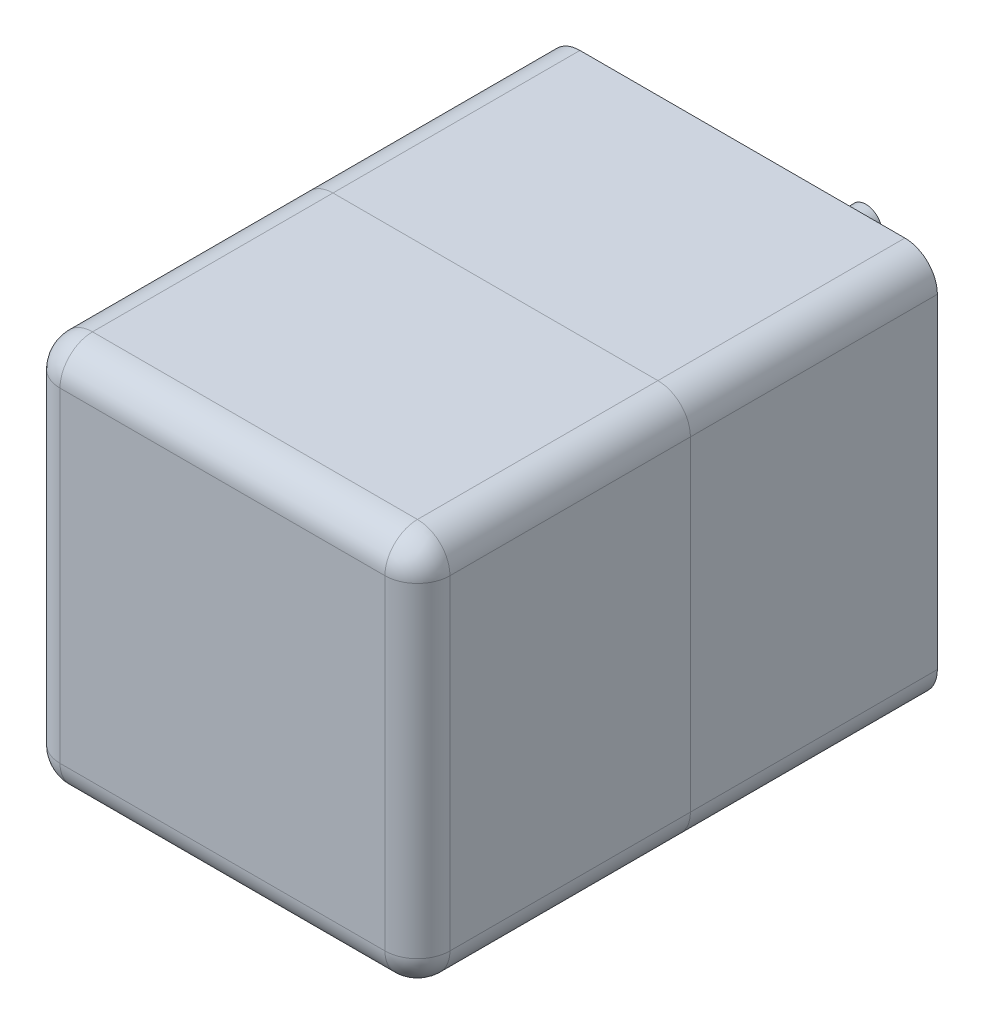
ISO-10303-21;
HEADER;
FILE_DESCRIPTION(('STEP AP214'),'2;1');
FILE_NAME('part.step','',(''),(''),'','','');
FILE_SCHEMA(('AUTOMOTIVE_DESIGN { 1 0 10303 214 1 1 1 1 }'));
ENDSEC;
DATA;
#1=APPLICATION_CONTEXT('core data for automotive mechanical design processes');
#2=APPLICATION_PROTOCOL_DEFINITION('international standard','automotive_design',2000,#1);
#3=PRODUCT_CONTEXT('',#1,'mechanical');
#4=PRODUCT('Part','Part','',(#3));
#5=PRODUCT_RELATED_PRODUCT_CATEGORY('part','',(#4));
#6=PRODUCT_DEFINITION_FORMATION('','',#4);
#7=PRODUCT_DEFINITION_CONTEXT('part definition',#1,'design');
#8=PRODUCT_DEFINITION('design','',#6,#7);
#9=PRODUCT_DEFINITION_SHAPE('','',#8);
#10=(LENGTH_UNIT() NAMED_UNIT(*) SI_UNIT(.MILLI.,.METRE.));
#11=(NAMED_UNIT(*) PLANE_ANGLE_UNIT() SI_UNIT($,.RADIAN.));
#12=(NAMED_UNIT(*) SI_UNIT($,.STERADIAN.) SOLID_ANGLE_UNIT());
#13=UNCERTAINTY_MEASURE_WITH_UNIT(LENGTH_MEASURE(1.E-05),#10,'distance_accuracy_value','');
#14=(GEOMETRIC_REPRESENTATION_CONTEXT(3) GLOBAL_UNCERTAINTY_ASSIGNED_CONTEXT((#13)) GLOBAL_UNIT_ASSIGNED_CONTEXT((#10,
#11,#12)) REPRESENTATION_CONTEXT('',''));
#15=CARTESIAN_POINT('',(0.,0.,0.));
#16=DIRECTION('',(0.,0.,1.));
#17=DIRECTION('',(1.,0.,0.));
#18=AXIS2_PLACEMENT_3D('',#15,#16,#17);
#19=CARTESIAN_POINT('',(60.,0.,-38.));
#20=DIRECTION('',(0.,1.,0.));
#21=DIRECTION('',(0.,0.,1.));
#22=AXIS2_PLACEMENT_3D('',#19,#20,#21);
#23=PLANE('',#22);
#24=DIRECTION('',(-1.,0.,0.));
#25=VECTOR('',#24,1.);
#26=CARTESIAN_POINT('',(60.,0.,0.));
#27=LINE('',#26,#25);
#28=CARTESIAN_POINT('',(55.,0.,0.));
#29=VERTEX_POINT('',#28);
#30=CARTESIAN_POINT('',(5.,0.,0.));
#31=VERTEX_POINT('',#30);
#32=EDGE_CURVE('E146',#29,#31,#27,.T.);
#33=ORIENTED_EDGE('',*,*,#32,.T.);
#34=DIRECTION('',(0.,0.,1.));
#35=VECTOR('',#34,1.);
#36=CARTESIAN_POINT('',(5.,0.,-38.));
#37=LINE('',#36,#35);
#38=CARTESIAN_POINT('',(5.,0.,-38.));
#39=VERTEX_POINT('',#38);
#40=EDGE_CURVE('E124',#31,#39,#37,.F.);
#41=ORIENTED_EDGE('',*,*,#40,.T.);
#42=DIRECTION('',(-1.,0.,0.));
#43=VECTOR('',#42,1.);
#44=CARTESIAN_POINT('',(60.,0.,-38.));
#45=LINE('',#44,#43);
#46=CARTESIAN_POINT('',(55.,0.,-38.));
#47=VERTEX_POINT('',#46);
#48=EDGE_CURVE('E156',#47,#39,#45,.T.);
#49=ORIENTED_EDGE('',*,*,#48,.F.);
#50=DIRECTION('',(0.,0.,1.));
#51=VECTOR('',#50,1.);
#52=CARTESIAN_POINT('',(55.,0.,-38.));
#53=LINE('',#52,#51);
#54=EDGE_CURVE('E129',#47,#29,#53,.T.);
#55=ORIENTED_EDGE('',*,*,#54,.T.);
#56=EDGE_LOOP('',(#33,#41,#49,#55));
#57=FACE_BOUND('',#56,.T.);
#58=ADVANCED_FACE('F53',(#57),#23,.F.);
#59=CARTESIAN_POINT('',(0.,0.,-38.));
#60=DIRECTION('',(1.,0.,0.));
#61=DIRECTION('',(0.,0.,-1.));
#62=AXIS2_PLACEMENT_3D('',#59,#60,#61);
#63=PLANE('',#62);
#64=DIRECTION('',(0.,1.,0.));
#65=VECTOR('',#64,1.);
#66=CARTESIAN_POINT('',(0.,0.,-38.));
#67=LINE('',#66,#65);
#68=CARTESIAN_POINT('',(0.,5.,-38.));
#69=VERTEX_POINT('',#68);
#70=CARTESIAN_POINT('',(0.,55.,-38.));
#71=VERTEX_POINT('',#70);
#72=EDGE_CURVE('E139',#69,#71,#67,.T.);
#73=ORIENTED_EDGE('',*,*,#72,.F.);
#74=DIRECTION('',(0.,0.,1.));
#75=VECTOR('',#74,1.);
#76=CARTESIAN_POINT('',(0.,5.,-38.));
#77=LINE('',#76,#75);
#78=CARTESIAN_POINT('',(0.,5.,0.));
#79=VERTEX_POINT('',#78);
#80=EDGE_CURVE('E123',#69,#79,#77,.T.);
#81=ORIENTED_EDGE('',*,*,#80,.T.);
#82=DIRECTION('',(0.,1.,0.));
#83=VECTOR('',#82,1.);
#84=CARTESIAN_POINT('',(0.,0.,0.));
#85=LINE('',#84,#83);
#86=CARTESIAN_POINT('',(0.,55.,0.));
#87=VERTEX_POINT('',#86);
#88=EDGE_CURVE('E136',#79,#87,#85,.T.);
#89=ORIENTED_EDGE('',*,*,#88,.T.);
#90=DIRECTION('',(0.,0.,1.));
#91=VECTOR('',#90,1.);
#92=CARTESIAN_POINT('',(0.,55.,-38.));
#93=LINE('',#92,#91);
#94=EDGE_CURVE('E141',#87,#71,#93,.F.);
#95=ORIENTED_EDGE('',*,*,#94,.T.);
#96=EDGE_LOOP('',(#73,#81,#89,#95));
#97=FACE_BOUND('',#96,.T.);
#98=ADVANCED_FACE('F135',(#97),#63,.F.);
#99=CARTESIAN_POINT('',(0.,60.,-38.));
#100=DIRECTION('',(0.,-1.,0.));
#101=DIRECTION('',(0.,0.,-1.));
#102=AXIS2_PLACEMENT_3D('',#99,#100,#101);
#103=PLANE('',#102);
#104=DIRECTION('',(1.,0.,0.));
#105=VECTOR('',#104,1.);
#106=CARTESIAN_POINT('',(0.,60.,0.));
#107=LINE('',#106,#105);
#108=CARTESIAN_POINT('',(5.,60.,0.));
#109=VERTEX_POINT('',#108);
#110=CARTESIAN_POINT('',(55.,60.,0.));
#111=VERTEX_POINT('',#110);
#112=EDGE_CURVE('E145',#109,#111,#107,.T.);
#113=ORIENTED_EDGE('',*,*,#112,.T.);
#114=DIRECTION('',(0.,0.,1.));
#115=VECTOR('',#114,1.);
#116=CARTESIAN_POINT('',(55.,60.,-38.));
#117=LINE('',#116,#115);
#118=CARTESIAN_POINT('',(55.,60.,-38.));
#119=VERTEX_POINT('',#118);
#120=EDGE_CURVE('E12',#111,#119,#117,.F.);
#121=ORIENTED_EDGE('',*,*,#120,.T.);
#122=DIRECTION('',(1.,0.,0.));
#123=VECTOR('',#122,1.);
#124=CARTESIAN_POINT('',(0.,60.,-38.));
#125=LINE('',#124,#123);
#126=CARTESIAN_POINT('',(5.,60.,-38.));
#127=VERTEX_POINT('',#126);
#128=EDGE_CURVE('E182',#127,#119,#125,.T.);
#129=ORIENTED_EDGE('',*,*,#128,.F.);
#130=DIRECTION('',(0.,0.,1.));
#131=VECTOR('',#130,1.);
#132=CARTESIAN_POINT('',(5.,60.,-38.));
#133=LINE('',#132,#131);
#134=EDGE_CURVE('E61',#127,#109,#133,.T.);
#135=ORIENTED_EDGE('',*,*,#134,.T.);
#136=EDGE_LOOP('',(#113,#121,#129,#135));
#137=FACE_BOUND('',#136,.T.);
#138=ADVANCED_FACE('F180',(#137),#103,.F.);
#139=CARTESIAN_POINT('',(60.,60.,-38.));
#140=DIRECTION('',(-1.,0.,0.));
#141=DIRECTION('',(0.,0.,1.));
#142=AXIS2_PLACEMENT_3D('',#139,#140,#141);
#143=PLANE('',#142);
#144=DIRECTION('',(0.,-1.,0.));
#145=VECTOR('',#144,1.);
#146=CARTESIAN_POINT('',(60.,60.,0.));
#147=LINE('',#146,#145);
#148=CARTESIAN_POINT('',(60.,55.,0.));
#149=VERTEX_POINT('',#148);
#150=CARTESIAN_POINT('',(60.,5.,0.));
#151=VERTEX_POINT('',#150);
#152=EDGE_CURVE('E149',#149,#151,#147,.T.);
#153=ORIENTED_EDGE('',*,*,#152,.T.);
#154=DIRECTION('',(0.,0.,1.));
#155=VECTOR('',#154,1.);
#156=CARTESIAN_POINT('',(60.,5.,-38.));
#157=LINE('',#156,#155);
#158=CARTESIAN_POINT('',(60.,5.,-38.));
#159=VERTEX_POINT('',#158);
#160=EDGE_CURVE('E68',#151,#159,#157,.F.);
#161=ORIENTED_EDGE('',*,*,#160,.T.);
#162=DIRECTION('',(0.,-1.,0.));
#163=VECTOR('',#162,1.);
#164=CARTESIAN_POINT('',(60.,60.,-38.));
#165=LINE('',#164,#163);
#166=CARTESIAN_POINT('',(60.,55.,-38.));
#167=VERTEX_POINT('',#166);
#168=EDGE_CURVE('E157',#167,#159,#165,.T.);
#169=ORIENTED_EDGE('',*,*,#168,.F.);
#170=DIRECTION('',(0.,0.,1.));
#171=VECTOR('',#170,1.);
#172=CARTESIAN_POINT('',(60.,55.,-38.));
#173=LINE('',#172,#171);
#174=EDGE_CURVE('E173',#167,#149,#173,.T.);
#175=ORIENTED_EDGE('',*,*,#174,.T.);
#176=EDGE_LOOP('',(#153,#161,#169,#175));
#177=FACE_BOUND('',#176,.T.);
#178=ADVANCED_FACE('F189',(#177),#143,.F.);
#179=CARTESIAN_POINT('',(0.,0.,-38.));
#180=DIRECTION('',(0.,0.,-1.));
#181=DIRECTION('',(-1.,0.,0.));
#182=AXIS2_PLACEMENT_3D('',#179,#180,#181);
#183=PLANE('',#182);
#184=CARTESIAN_POINT('',(30.,40.,-38.));
#185=DIRECTION('',(0.,0.,-1.));
#186=DIRECTION('',(-1.,0.,0.));
#187=AXIS2_PLACEMENT_3D('',#184,#185,#186);
#188=CIRCLE('',#187,12.);
#189=CARTESIAN_POINT('',(18.,40.,-38.));
#190=VERTEX_POINT('',#189);
#191=EDGE_CURVE('E220',#190,#190,#188,.T.);
#192=ORIENTED_EDGE('',*,*,#191,.F.);
#193=EDGE_LOOP('',(#192));
#194=FACE_BOUND('',#193,.T.);
#195=CARTESIAN_POINT('',(5.25126265847084,5.25126265847083,-38.));
#196=DIRECTION('',(0.,0.,-1.));
#197=DIRECTION('',(1.,0.,0.));
#198=AXIS2_PLACEMENT_3D('',#195,#196,#197);
#199=CIRCLE('',#198,2.25);
#200=CARTESIAN_POINT('',(7.50126265847084,5.25126265847083,-38.));
#201=VERTEX_POINT('',#200);
#202=EDGE_CURVE('E202',#201,#201,#199,.T.);
#203=ORIENTED_EDGE('',*,*,#202,.F.);
#204=EDGE_LOOP('',(#203));
#205=FACE_BOUND('',#204,.T.);
#206=CARTESIAN_POINT('',(54.7487373415292,5.25126265847084,-38.));
#207=DIRECTION('',(0.,0.,-1.));
#208=DIRECTION('',(-1.,0.,0.));
#209=AXIS2_PLACEMENT_3D('',#206,#207,#208);
#210=CIRCLE('',#209,2.25);
#211=CARTESIAN_POINT('',(52.4987373415292,5.25126265847084,-38.));
#212=VERTEX_POINT('',#211);
#213=EDGE_CURVE('E209',#212,#212,#210,.T.);
#214=ORIENTED_EDGE('',*,*,#213,.F.);
#215=EDGE_LOOP('',(#214));
#216=FACE_BOUND('',#215,.T.);
#217=CARTESIAN_POINT('',(54.7487373415292,54.7487373415292,-38.));
#218=DIRECTION('',(0.,0.,-1.));
#219=DIRECTION('',(1.,0.,0.));
#220=AXIS2_PLACEMENT_3D('',#217,#218,#219);
#221=CIRCLE('',#220,2.25);
#222=CARTESIAN_POINT('',(56.9987373415292,54.7487373415292,-38.));
#223=VERTEX_POINT('',#222);
#224=EDGE_CURVE('E215',#223,#223,#221,.T.);
#225=ORIENTED_EDGE('',*,*,#224,.F.);
#226=EDGE_LOOP('',(#225));
#227=FACE_BOUND('',#226,.T.);
#228=CARTESIAN_POINT('',(5.25126265847084,54.7487373415292,-38.));
#229=DIRECTION('',(0.,0.,-1.));
#230=DIRECTION('',(-1.,0.,0.));
#231=AXIS2_PLACEMENT_3D('',#228,#229,#230);
#232=CIRCLE('',#231,2.25);
#233=CARTESIAN_POINT('',(3.00126265847084,54.7487373415292,-38.));
#234=VERTEX_POINT('',#233);
#235=EDGE_CURVE('E196',#234,#234,#232,.T.);
#236=ORIENTED_EDGE('',*,*,#235,.F.);
#237=EDGE_LOOP('',(#236));
#238=FACE_BOUND('',#237,.T.);
#239=ORIENTED_EDGE('',*,*,#48,.T.);
#240=CARTESIAN_POINT('',(5.,5.,-38.));
#241=DIRECTION('',(0.,0.,-1.));
#242=DIRECTION('',(-1.,0.,0.));
#243=AXIS2_PLACEMENT_3D('',#240,#241,#242);
#244=CIRCLE('',#243,5.);
#245=EDGE_CURVE('E171',#39,#69,#244,.T.);
#246=ORIENTED_EDGE('',*,*,#245,.T.);
#247=ORIENTED_EDGE('',*,*,#72,.T.);
#248=CARTESIAN_POINT('',(5.,55.,-38.));
#249=DIRECTION('',(0.,0.,-1.));
#250=DIRECTION('',(-1.,0.,0.));
#251=AXIS2_PLACEMENT_3D('',#248,#249,#250);
#252=CIRCLE('',#251,5.);
#253=EDGE_CURVE('E166',#71,#127,#252,.T.);
#254=ORIENTED_EDGE('',*,*,#253,.T.);
#255=ORIENTED_EDGE('',*,*,#128,.T.);
#256=CARTESIAN_POINT('',(55.,55.,-38.));
#257=DIRECTION('',(0.,0.,-1.));
#258=DIRECTION('',(-1.,0.,0.));
#259=AXIS2_PLACEMENT_3D('',#256,#257,#258);
#260=CIRCLE('',#259,5.);
#261=EDGE_CURVE('E75',#119,#167,#260,.T.);
#262=ORIENTED_EDGE('',*,*,#261,.T.);
#263=ORIENTED_EDGE('',*,*,#168,.T.);
#264=CARTESIAN_POINT('',(55.,5.,-38.));
#265=DIRECTION('',(0.,0.,-1.));
#266=DIRECTION('',(-1.,0.,0.));
#267=AXIS2_PLACEMENT_3D('',#264,#265,#266);
#268=CIRCLE('',#267,5.);
#269=EDGE_CURVE('E169',#159,#47,#268,.T.);
#270=ORIENTED_EDGE('',*,*,#269,.T.);
#271=EDGE_LOOP('',(#239,#246,#247,#254,#255,#262,#263,#270));
#272=FACE_BOUND('',#271,.T.);
#273=ADVANCED_FACE('F289',(#194,#205,#216,#227,#238,#272),#183,.T.);
#274=CARTESIAN_POINT('',(0.,0.,0.));
#275=DIRECTION('',(0.,0.,-1.));
#276=DIRECTION('',(-1.,0.,0.));
#277=AXIS2_PLACEMENT_3D('',#274,#275,#276);
#278=PLANE('',#277);
#279=ORIENTED_EDGE('',*,*,#88,.F.);
#280=CARTESIAN_POINT('',(5.,5.,0.));
#281=DIRECTION('',(0.,0.,-1.));
#282=DIRECTION('',(-1.,0.,0.));
#283=AXIS2_PLACEMENT_3D('',#280,#281,#282);
#284=CIRCLE('',#283,5.);
#285=EDGE_CURVE('E119',#79,#31,#284,.F.);
#286=ORIENTED_EDGE('',*,*,#285,.T.);
#287=ORIENTED_EDGE('',*,*,#32,.F.);
#288=CARTESIAN_POINT('',(55.,5.,0.));
#289=DIRECTION('',(0.,0.,-1.));
#290=DIRECTION('',(-1.,0.,0.));
#291=AXIS2_PLACEMENT_3D('',#288,#289,#290);
#292=CIRCLE('',#291,5.);
#293=EDGE_CURVE('E130',#29,#151,#292,.F.);
#294=ORIENTED_EDGE('',*,*,#293,.T.);
#295=ORIENTED_EDGE('',*,*,#152,.F.);
#296=CARTESIAN_POINT('',(55.,55.,0.));
#297=DIRECTION('',(0.,0.,-1.));
#298=DIRECTION('',(-1.,0.,0.));
#299=AXIS2_PLACEMENT_3D('',#296,#297,#298);
#300=CIRCLE('',#299,5.);
#301=EDGE_CURVE('E160',#149,#111,#300,.F.);
#302=ORIENTED_EDGE('',*,*,#301,.T.);
#303=ORIENTED_EDGE('',*,*,#112,.F.);
#304=CARTESIAN_POINT('',(5.,55.,0.));
#305=DIRECTION('',(0.,0.,-1.));
#306=DIRECTION('',(-1.,0.,0.));
#307=AXIS2_PLACEMENT_3D('',#304,#305,#306);
#308=CIRCLE('',#307,5.);
#309=EDGE_CURVE('E140',#109,#87,#308,.F.);
#310=ORIENTED_EDGE('',*,*,#309,.T.);
#311=EDGE_LOOP('',(#279,#286,#287,#294,#295,#302,#303,#310));
#312=FACE_BOUND('',#311,.T.);
#313=ADVANCED_FACE('F143',(#312),#278,.F.);
#314=CARTESIAN_POINT('',(5.,5.,-38.));
#315=DIRECTION('',(0.,0.,1.));
#316=DIRECTION('',(1.,0.,0.));
#317=AXIS2_PLACEMENT_3D('',#314,#315,#316);
#318=CYLINDRICAL_SURFACE('',#317,5.);
#319=ORIENTED_EDGE('',*,*,#245,.F.);
#320=ORIENTED_EDGE('',*,*,#40,.F.);
#321=ORIENTED_EDGE('',*,*,#285,.F.);
#322=ORIENTED_EDGE('',*,*,#80,.F.);
#323=EDGE_LOOP('',(#319,#320,#321,#322));
#324=FACE_BOUND('',#323,.T.);
#325=ADVANCED_FACE('F122',(#324),#318,.T.);
#326=CARTESIAN_POINT('',(55.,5.,-38.));
#327=DIRECTION('',(0.,0.,1.));
#328=DIRECTION('',(1.,0.,0.));
#329=AXIS2_PLACEMENT_3D('',#326,#327,#328);
#330=CYLINDRICAL_SURFACE('',#329,5.);
#331=ORIENTED_EDGE('',*,*,#269,.F.);
#332=ORIENTED_EDGE('',*,*,#160,.F.);
#333=ORIENTED_EDGE('',*,*,#293,.F.);
#334=ORIENTED_EDGE('',*,*,#54,.F.);
#335=EDGE_LOOP('',(#331,#332,#333,#334));
#336=FACE_BOUND('',#335,.T.);
#337=ADVANCED_FACE('F275',(#336),#330,.T.);
#338=CARTESIAN_POINT('',(55.,55.,-38.));
#339=DIRECTION('',(0.,0.,1.));
#340=DIRECTION('',(1.,0.,0.));
#341=AXIS2_PLACEMENT_3D('',#338,#339,#340);
#342=CYLINDRICAL_SURFACE('',#341,5.);
#343=ORIENTED_EDGE('',*,*,#261,.F.);
#344=ORIENTED_EDGE('',*,*,#120,.F.);
#345=ORIENTED_EDGE('',*,*,#301,.F.);
#346=ORIENTED_EDGE('',*,*,#174,.F.);
#347=EDGE_LOOP('',(#343,#344,#345,#346));
#348=FACE_BOUND('',#347,.T.);
#349=ADVANCED_FACE('F188',(#348),#342,.T.);
#350=CARTESIAN_POINT('',(5.,55.,-38.));
#351=DIRECTION('',(0.,0.,1.));
#352=DIRECTION('',(1.,0.,0.));
#353=AXIS2_PLACEMENT_3D('',#350,#351,#352);
#354=CYLINDRICAL_SURFACE('',#353,5.);
#355=ORIENTED_EDGE('',*,*,#253,.F.);
#356=ORIENTED_EDGE('',*,*,#94,.F.);
#357=ORIENTED_EDGE('',*,*,#309,.F.);
#358=ORIENTED_EDGE('',*,*,#134,.F.);
#359=EDGE_LOOP('',(#355,#356,#357,#358));
#360=FACE_BOUND('',#359,.T.);
#361=ADVANCED_FACE('F55',(#360),#354,.T.);
#362=CARTESIAN_POINT('',(5.25126265847084,54.7487373415292,-28.));
#363=DIRECTION('',(0.,0.,-1.));
#364=DIRECTION('',(-1.,0.,0.));
#365=AXIS2_PLACEMENT_3D('',#362,#363,#364);
#366=CYLINDRICAL_SURFACE('',#365,2.25);
#367=CARTESIAN_POINT('',(5.25126265847084,54.7487373415292,-28.));
#368=DIRECTION('',(0.,0.,-1.));
#369=DIRECTION('',(-1.,0.,0.));
#370=AXIS2_PLACEMENT_3D('',#367,#368,#369);
#371=CIRCLE('',#370,2.25);
#372=CARTESIAN_POINT('',(3.00126265847084,54.7487373415292,-28.));
#373=VERTEX_POINT('',#372);
#374=EDGE_CURVE('E151',#373,#373,#371,.T.);
#375=ORIENTED_EDGE('',*,*,#374,.F.);
#376=EDGE_LOOP('',(#375));
#377=FACE_BOUND('',#376,.T.);
#378=ORIENTED_EDGE('',*,*,#235,.T.);
#379=EDGE_LOOP('',(#378));
#380=FACE_BOUND('',#379,.T.);
#381=ADVANCED_FACE('F282',(#377,#380),#366,.F.);
#382=CARTESIAN_POINT('',(5.25126265847084,54.7487373415292,-28.));
#383=DIRECTION('',(0.,0.,-1.));
#384=DIRECTION('',(-1.,0.,0.));
#385=AXIS2_PLACEMENT_3D('',#382,#383,#384);
#386=PLANE('',#385);
#387=ORIENTED_EDGE('',*,*,#374,.T.);
#388=EDGE_LOOP('',(#387));
#389=FACE_BOUND('',#388,.T.);
#390=ADVANCED_FACE('F286',(#389),#386,.T.);
#391=CARTESIAN_POINT('',(54.7487373415292,54.7487373415292,-28.));
#392=DIRECTION('',(0.,0.,-1.));
#393=DIRECTION('',(-1.,0.,0.));
#394=AXIS2_PLACEMENT_3D('',#391,#392,#393);
#395=CYLINDRICAL_SURFACE('',#394,2.25);
#396=CARTESIAN_POINT('',(54.7487373415292,54.7487373415292,-28.));
#397=DIRECTION('',(0.,0.,-1.));
#398=DIRECTION('',(1.,0.,0.));
#399=AXIS2_PLACEMENT_3D('',#396,#397,#398);
#400=CIRCLE('',#399,2.25);
#401=CARTESIAN_POINT('',(56.9987373415292,54.7487373415292,-28.));
#402=VERTEX_POINT('',#401);
#403=EDGE_CURVE('E199',#402,#402,#400,.T.);
#404=ORIENTED_EDGE('',*,*,#403,.F.);
#405=EDGE_LOOP('',(#404));
#406=FACE_BOUND('',#405,.T.);
#407=ORIENTED_EDGE('',*,*,#224,.T.);
#408=EDGE_LOOP('',(#407));
#409=FACE_BOUND('',#408,.T.);
#410=ADVANCED_FACE('F355',(#406,#409),#395,.F.);
#411=CARTESIAN_POINT('',(54.7487373415292,54.7487373415292,-28.));
#412=DIRECTION('',(0.,0.,1.));
#413=DIRECTION('',(1.,0.,0.));
#414=AXIS2_PLACEMENT_3D('',#411,#412,#413);
#415=PLANE('',#414);
#416=ORIENTED_EDGE('',*,*,#403,.T.);
#417=EDGE_LOOP('',(#416));
#418=FACE_BOUND('',#417,.T.);
#419=ADVANCED_FACE('F364',(#418),#415,.F.);
#420=CARTESIAN_POINT('',(54.7487373415292,5.25126265847084,-28.));
#421=DIRECTION('',(0.,0.,-1.));
#422=DIRECTION('',(-1.,0.,0.));
#423=AXIS2_PLACEMENT_3D('',#420,#421,#422);
#424=CYLINDRICAL_SURFACE('',#423,2.25);
#425=CARTESIAN_POINT('',(54.7487373415292,5.25126265847084,-28.));
#426=DIRECTION('',(0.,0.,-1.));
#427=DIRECTION('',(-1.,0.,0.));
#428=AXIS2_PLACEMENT_3D('',#425,#426,#427);
#429=CIRCLE('',#428,2.25);
#430=CARTESIAN_POINT('',(52.4987373415292,5.25126265847084,-28.));
#431=VERTEX_POINT('',#430);
#432=EDGE_CURVE('E212',#431,#431,#429,.T.);
#433=ORIENTED_EDGE('',*,*,#432,.F.);
#434=EDGE_LOOP('',(#433));
#435=FACE_BOUND('',#434,.T.);
#436=ORIENTED_EDGE('',*,*,#213,.T.);
#437=EDGE_LOOP('',(#436));
#438=FACE_BOUND('',#437,.T.);
#439=ADVANCED_FACE('F374',(#435,#438),#424,.F.);
#440=CARTESIAN_POINT('',(54.7487373415292,5.25126265847084,-28.));
#441=DIRECTION('',(0.,0.,-1.));
#442=DIRECTION('',(-1.,0.,0.));
#443=AXIS2_PLACEMENT_3D('',#440,#441,#442);
#444=PLANE('',#443);
#445=ORIENTED_EDGE('',*,*,#432,.T.);
#446=EDGE_LOOP('',(#445));
#447=FACE_BOUND('',#446,.T.);
#448=ADVANCED_FACE('F384',(#447),#444,.T.);
#449=CARTESIAN_POINT('',(5.25126265847084,5.25126265847083,-28.));
#450=DIRECTION('',(0.,0.,-1.));
#451=DIRECTION('',(-1.,0.,0.));
#452=AXIS2_PLACEMENT_3D('',#449,#450,#451);
#453=CYLINDRICAL_SURFACE('',#452,2.25);
#454=CARTESIAN_POINT('',(5.25126265847084,5.25126265847083,-28.));
#455=DIRECTION('',(0.,0.,-1.));
#456=DIRECTION('',(1.,0.,0.));
#457=AXIS2_PLACEMENT_3D('',#454,#455,#456);
#458=CIRCLE('',#457,2.25);
#459=CARTESIAN_POINT('',(7.50126265847084,5.25126265847083,-28.));
#460=VERTEX_POINT('',#459);
#461=EDGE_CURVE('E205',#460,#460,#458,.T.);
#462=ORIENTED_EDGE('',*,*,#461,.F.);
#463=EDGE_LOOP('',(#462));
#464=FACE_BOUND('',#463,.T.);
#465=ORIENTED_EDGE('',*,*,#202,.T.);
#466=EDGE_LOOP('',(#465));
#467=FACE_BOUND('',#466,.T.);
#468=ADVANCED_FACE('F394',(#464,#467),#453,.F.);
#469=CARTESIAN_POINT('',(5.25126265847084,5.25126265847083,-28.));
#470=DIRECTION('',(0.,0.,1.));
#471=DIRECTION('',(1.,0.,0.));
#472=AXIS2_PLACEMENT_3D('',#469,#470,#471);
#473=PLANE('',#472);
#474=ORIENTED_EDGE('',*,*,#461,.T.);
#475=EDGE_LOOP('',(#474));
#476=FACE_BOUND('',#475,.T.);
#477=ADVANCED_FACE('F404',(#476),#473,.F.);
#478=CARTESIAN_POINT('',(30.,40.,-42.));
#479=DIRECTION('',(0.,0.,1.));
#480=DIRECTION('',(1.,0.,0.));
#481=AXIS2_PLACEMENT_3D('',#478,#479,#480);
#482=CYLINDRICAL_SURFACE('',#481,12.);
#483=CARTESIAN_POINT('',(30.,40.,-42.));
#484=DIRECTION('',(0.,0.,-1.));
#485=DIRECTION('',(-1.,0.,0.));
#486=AXIS2_PLACEMENT_3D('',#483,#484,#485);
#487=CIRCLE('',#486,12.);
#488=CARTESIAN_POINT('',(18.,40.,-42.));
#489=VERTEX_POINT('',#488);
#490=EDGE_CURVE('E206',#489,#489,#487,.T.);
#491=ORIENTED_EDGE('',*,*,#490,.F.);
#492=EDGE_LOOP('',(#491));
#493=FACE_BOUND('',#492,.T.);
#494=ORIENTED_EDGE('',*,*,#191,.T.);
#495=EDGE_LOOP('',(#494));
#496=FACE_BOUND('',#495,.T.);
#497=ADVANCED_FACE('F261',(#493,#496),#482,.T.);
#498=CARTESIAN_POINT('',(30.,40.,-42.));
#499=DIRECTION('',(0.,0.,-1.));
#500=DIRECTION('',(-1.,0.,0.));
#501=AXIS2_PLACEMENT_3D('',#498,#499,#500);
#502=PLANE('',#501);
#503=CARTESIAN_POINT('',(30.,40.,-42.));
#504=DIRECTION('',(0.,0.,-1.));
#505=DIRECTION('',(-1.,0.,0.));
#506=AXIS2_PLACEMENT_3D('',#503,#504,#505);
#507=CIRCLE('',#506,5.);
#508=CARTESIAN_POINT('',(25.,40.,-42.));
#509=VERTEX_POINT('',#508);
#510=EDGE_CURVE('E223',#509,#509,#507,.T.);
#511=ORIENTED_EDGE('',*,*,#510,.F.);
#512=EDGE_LOOP('',(#511));
#513=FACE_BOUND('',#512,.T.);
#514=ORIENTED_EDGE('',*,*,#490,.T.);
#515=EDGE_LOOP('',(#514));
#516=FACE_BOUND('',#515,.T.);
#517=ADVANCED_FACE('F254',(#513,#516),#502,.T.);
#518=CARTESIAN_POINT('',(30.,40.,-37.));
#519=DIRECTION('',(0.,0.,-1.));
#520=DIRECTION('',(-1.,0.,0.));
#521=AXIS2_PLACEMENT_3D('',#518,#519,#520);
#522=CYLINDRICAL_SURFACE('',#521,5.);
#523=ORIENTED_EDGE('',*,*,#510,.T.);
#524=EDGE_LOOP('',(#523));
#525=FACE_BOUND('',#524,.T.);
#526=CARTESIAN_POINT('',(30.,40.,-37.));
#527=DIRECTION('',(0.,0.,-1.));
#528=DIRECTION('',(-1.,0.,0.));
#529=AXIS2_PLACEMENT_3D('',#526,#527,#528);
#530=CIRCLE('',#529,5.);
#531=CARTESIAN_POINT('',(25.,40.,-37.));
#532=VERTEX_POINT('',#531);
#533=EDGE_CURVE('E228',#532,#532,#530,.T.);
#534=ORIENTED_EDGE('',*,*,#533,.F.);
#535=EDGE_LOOP('',(#534));
#536=FACE_BOUND('',#535,.T.);
#537=ADVANCED_FACE('F249',(#525,#536),#522,.F.);
#538=CARTESIAN_POINT('',(30.,40.,-37.));
#539=DIRECTION('',(0.,0.,-1.));
#540=DIRECTION('',(-1.,0.,0.));
#541=AXIS2_PLACEMENT_3D('',#538,#539,#540);
#542=PLANE('',#541);
#543=CARTESIAN_POINT('',(30.,40.,-37.));
#544=DIRECTION('',(0.,0.,-1.));
#545=DIRECTION('',(-1.,0.,0.));
#546=AXIS2_PLACEMENT_3D('',#543,#544,#545);
#547=CIRCLE('',#546,2.5);
#548=CARTESIAN_POINT('',(27.5,40.,-37.));
#549=VERTEX_POINT('',#548);
#550=EDGE_CURVE('E232',#549,#549,#547,.T.);
#551=ORIENTED_EDGE('',*,*,#550,.F.);
#552=EDGE_LOOP('',(#551));
#553=FACE_BOUND('',#552,.T.);
#554=ORIENTED_EDGE('',*,*,#533,.T.);
#555=EDGE_LOOP('',(#554));
#556=FACE_BOUND('',#555,.T.);
#557=ADVANCED_FACE('F243',(#553,#556),#542,.T.);
#558=CARTESIAN_POINT('',(30.,40.,-57.));
#559=DIRECTION('',(0.,0.,1.));
#560=DIRECTION('',(1.,0.,0.));
#561=AXIS2_PLACEMENT_3D('',#558,#559,#560);
#562=CYLINDRICAL_SURFACE('',#561,2.5);
#563=CARTESIAN_POINT('',(30.,40.,-57.));
#564=DIRECTION('',(0.,0.,-1.));
#565=DIRECTION('',(-1.,0.,0.));
#566=AXIS2_PLACEMENT_3D('',#563,#564,#565);
#567=CIRCLE('',#566,2.5);
#568=CARTESIAN_POINT('',(27.5,40.,-57.));
#569=VERTEX_POINT('',#568);
#570=EDGE_CURVE('E231',#569,#569,#567,.T.);
#571=ORIENTED_EDGE('',*,*,#570,.F.);
#572=EDGE_LOOP('',(#571));
#573=FACE_BOUND('',#572,.T.);
#574=ORIENTED_EDGE('',*,*,#550,.T.);
#575=EDGE_LOOP('',(#574));
#576=FACE_BOUND('',#575,.T.);
#577=ADVANCED_FACE('F240',(#573,#576),#562,.T.);
#578=CARTESIAN_POINT('',(30.,40.,-57.));
#579=DIRECTION('',(0.,0.,-1.));
#580=DIRECTION('',(-1.,0.,0.));
#581=AXIS2_PLACEMENT_3D('',#578,#579,#580);
#582=PLANE('',#581);
#583=ORIENTED_EDGE('',*,*,#570,.T.);
#584=EDGE_LOOP('',(#583));
#585=FACE_BOUND('',#584,.T.);
#586=ADVANCED_FACE('F238',(#585),#582,.T.);
#587=CLOSED_SHELL('',(#58,#98,#138,#178,#273,#313,#325,#337,#349,#361,#381,#390,#410,#419,#439,
#448,#468,#477,#497,#517,#537,#557,#577,#586));
#588=MANIFOLD_SOLID_BREP('B2',#587);
#589=CARTESIAN_POINT('',(0.,0.,42.));
#590=DIRECTION('',(1.,0.,0.));
#591=DIRECTION('',(0.,0.,-1.));
#592=AXIS2_PLACEMENT_3D('',#589,#590,#591);
#593=PLANE('',#592);
#594=DIRECTION('',(0.,0.,-1.));
#595=VECTOR('',#594,1.);
#596=CARTESIAN_POINT('',(0.,5.,42.));
#597=LINE('',#596,#595);
#598=CARTESIAN_POINT('',(0.,5.,0.));
#599=VERTEX_POINT('',#598);
#600=CARTESIAN_POINT('',(0.,5.,37.));
#601=VERTEX_POINT('',#600);
#602=EDGE_CURVE('E585',#599,#601,#597,.F.);
#603=ORIENTED_EDGE('',*,*,#602,.T.);
#604=DIRECTION('',(0.,-1.,0.));
#605=VECTOR('',#604,1.);
#606=CARTESIAN_POINT('',(0.,0.,37.));
#607=LINE('',#606,#605);
#608=CARTESIAN_POINT('',(0.,55.,37.));
#609=VERTEX_POINT('',#608);
#610=EDGE_CURVE('E632',#601,#609,#607,.F.);
#611=ORIENTED_EDGE('',*,*,#610,.T.);
#612=DIRECTION('',(0.,0.,-1.));
#613=VECTOR('',#612,1.);
#614=CARTESIAN_POINT('',(0.,55.,42.));
#615=LINE('',#614,#613);
#616=CARTESIAN_POINT('',(0.,55.,0.));
#617=VERTEX_POINT('',#616);
#618=EDGE_CURVE('E589',#609,#617,#615,.T.);
#619=ORIENTED_EDGE('',*,*,#618,.T.);
#620=DIRECTION('',(0.,-1.,0.));
#621=VECTOR('',#620,1.);
#622=CARTESIAN_POINT('',(0.,0.,0.));
#623=LINE('',#622,#621);
#624=EDGE_CURVE('E596',#617,#599,#623,.T.);
#625=ORIENTED_EDGE('',*,*,#624,.T.);
#626=EDGE_LOOP('',(#603,#611,#619,#625));
#627=FACE_BOUND('',#626,.T.);
#628=ADVANCED_FACE('F490',(#627),#593,.F.);
#629=CARTESIAN_POINT('',(0.,0.,42.));
#630=DIRECTION('',(0.,1.,0.));
#631=DIRECTION('',(0.,0.,1.));
#632=AXIS2_PLACEMENT_3D('',#629,#630,#631);
#633=PLANE('',#632);
#634=DIRECTION('',(0.,0.,-1.));
#635=VECTOR('',#634,1.);
#636=CARTESIAN_POINT('',(55.,0.,42.));
#637=LINE('',#636,#635);
#638=CARTESIAN_POINT('',(55.,0.,0.));
#639=VERTEX_POINT('',#638);
#640=CARTESIAN_POINT('',(55.,0.,37.));
#641=VERTEX_POINT('',#640);
#642=EDGE_CURVE('E579',#639,#641,#637,.F.);
#643=ORIENTED_EDGE('',*,*,#642,.T.);
#644=DIRECTION('',(1.,0.,0.));
#645=VECTOR('',#644,1.);
#646=CARTESIAN_POINT('',(0.,0.,37.));
#647=LINE('',#646,#645);
#648=CARTESIAN_POINT('',(5.,0.,37.));
#649=VERTEX_POINT('',#648);
#650=EDGE_CURVE('E51',#641,#649,#647,.F.);
#651=ORIENTED_EDGE('',*,*,#650,.T.);
#652=DIRECTION('',(0.,0.,-1.));
#653=VECTOR('',#652,1.);
#654=CARTESIAN_POINT('',(5.,0.,42.));
#655=LINE('',#654,#653);
#656=CARTESIAN_POINT('',(5.,0.,0.));
#657=VERTEX_POINT('',#656);
#658=EDGE_CURVE('E569',#649,#657,#655,.T.);
#659=ORIENTED_EDGE('',*,*,#658,.T.);
#660=DIRECTION('',(1.,0.,0.));
#661=VECTOR('',#660,1.);
#662=CARTESIAN_POINT('',(0.,0.,0.));
#663=LINE('',#662,#661);
#664=EDGE_CURVE('E573',#657,#639,#663,.T.);
#665=ORIENTED_EDGE('',*,*,#664,.T.);
#666=EDGE_LOOP('',(#643,#651,#659,#665));
#667=FACE_BOUND('',#666,.T.);
#668=ADVANCED_FACE('F571',(#667),#633,.F.);
#669=CARTESIAN_POINT('',(60.,0.,42.));
#670=DIRECTION('',(-1.,0.,0.));
#671=DIRECTION('',(0.,0.,1.));
#672=AXIS2_PLACEMENT_3D('',#669,#670,#671);
#673=PLANE('',#672);
#674=DIRECTION('',(0.,0.,-1.));
#675=VECTOR('',#674,1.);
#676=CARTESIAN_POINT('',(60.,55.,42.));
#677=LINE('',#676,#675);
#678=CARTESIAN_POINT('',(60.,55.,0.));
#679=VERTEX_POINT('',#678);
#680=CARTESIAN_POINT('',(60.,55.,37.));
#681=VERTEX_POINT('',#680);
#682=EDGE_CURVE('E612',#679,#681,#677,.F.);
#683=ORIENTED_EDGE('',*,*,#682,.T.);
#684=DIRECTION('',(0.,1.,0.));
#685=VECTOR('',#684,1.);
#686=CARTESIAN_POINT('',(60.,0.,37.));
#687=LINE('',#686,#685);
#688=CARTESIAN_POINT('',(60.,5.,37.));
#689=VERTEX_POINT('',#688);
#690=EDGE_CURVE('E514',#681,#689,#687,.F.);
#691=ORIENTED_EDGE('',*,*,#690,.T.);
#692=DIRECTION('',(0.,0.,-1.));
#693=VECTOR('',#692,1.);
#694=CARTESIAN_POINT('',(60.,5.,42.));
#695=LINE('',#694,#693);
#696=CARTESIAN_POINT('',(60.,5.,0.));
#697=VERTEX_POINT('',#696);
#698=EDGE_CURVE('E614',#689,#697,#695,.T.);
#699=ORIENTED_EDGE('',*,*,#698,.T.);
#700=DIRECTION('',(0.,1.,0.));
#701=VECTOR('',#700,1.);
#702=CARTESIAN_POINT('',(60.,0.,0.));
#703=LINE('',#702,#701);
#704=EDGE_CURVE('E595',#697,#679,#703,.T.);
#705=ORIENTED_EDGE('',*,*,#704,.T.);
#706=EDGE_LOOP('',(#683,#691,#699,#705));
#707=FACE_BOUND('',#706,.T.);
#708=ADVANCED_FACE('F676',(#707),#673,.F.);
#709=CARTESIAN_POINT('',(0.,60.,42.));
#710=DIRECTION('',(0.,-1.,0.));
#711=DIRECTION('',(0.,0.,-1.));
#712=AXIS2_PLACEMENT_3D('',#709,#710,#711);
#713=PLANE('',#712);
#714=DIRECTION('',(0.,0.,-1.));
#715=VECTOR('',#714,1.);
#716=CARTESIAN_POINT('',(5.,60.,42.));
#717=LINE('',#716,#715);
#718=CARTESIAN_POINT('',(5.,60.,0.));
#719=VERTEX_POINT('',#718);
#720=CARTESIAN_POINT('',(5.,60.,37.));
#721=VERTEX_POINT('',#720);
#722=EDGE_CURVE('E618',#719,#721,#717,.F.);
#723=ORIENTED_EDGE('',*,*,#722,.T.);
#724=DIRECTION('',(-1.,0.,0.));
#725=VECTOR('',#724,1.);
#726=CARTESIAN_POINT('',(0.,60.,37.));
#727=LINE('',#726,#725);
#728=CARTESIAN_POINT('',(55.,60.,37.));
#729=VERTEX_POINT('',#728);
#730=EDGE_CURVE('E636',#721,#729,#727,.F.);
#731=ORIENTED_EDGE('',*,*,#730,.T.);
#732=DIRECTION('',(0.,0.,-1.));
#733=VECTOR('',#732,1.);
#734=CARTESIAN_POINT('',(55.,60.,42.));
#735=LINE('',#734,#733);
#736=CARTESIAN_POINT('',(55.,60.,0.));
#737=VERTEX_POINT('',#736);
#738=EDGE_CURVE('E616',#729,#737,#735,.T.);
#739=ORIENTED_EDGE('',*,*,#738,.T.);
#740=DIRECTION('',(-1.,0.,0.));
#741=VECTOR('',#740,1.);
#742=CARTESIAN_POINT('',(0.,60.,0.));
#743=LINE('',#742,#741);
#744=EDGE_CURVE('E599',#737,#719,#743,.T.);
#745=ORIENTED_EDGE('',*,*,#744,.T.);
#746=EDGE_LOOP('',(#723,#731,#739,#745));
#747=FACE_BOUND('',#746,.T.);
#748=ADVANCED_FACE('F681',(#747),#713,.F.);
#749=CARTESIAN_POINT('',(0.,0.,42.));
#750=DIRECTION('',(0.,0.,-1.));
#751=DIRECTION('',(-1.,0.,0.));
#752=AXIS2_PLACEMENT_3D('',#749,#750,#751);
#753=PLANE('',#752);
#754=DIRECTION('',(-1.,0.,0.));
#755=VECTOR('',#754,1.);
#756=CARTESIAN_POINT('',(0.,55.,42.));
#757=LINE('',#756,#755);
#758=CARTESIAN_POINT('',(55.,55.,42.));
#759=VERTEX_POINT('',#758);
#760=CARTESIAN_POINT('',(5.,55.,42.));
#761=VERTEX_POINT('',#760);
#762=EDGE_CURVE('E627',#759,#761,#757,.T.);
#763=ORIENTED_EDGE('',*,*,#762,.T.);
#764=DIRECTION('',(0.,-1.,0.));
#765=VECTOR('',#764,1.);
#766=CARTESIAN_POINT('',(5.,0.,42.));
#767=LINE('',#766,#765);
#768=CARTESIAN_POINT('',(5.,5.,42.));
#769=VERTEX_POINT('',#768);
#770=EDGE_CURVE('E629',#761,#769,#767,.T.);
#771=ORIENTED_EDGE('',*,*,#770,.T.);
#772=DIRECTION('',(1.,0.,0.));
#773=VECTOR('',#772,1.);
#774=CARTESIAN_POINT('',(0.,5.,42.));
#775=LINE('',#774,#773);
#776=CARTESIAN_POINT('',(55.,5.,42.));
#777=VERTEX_POINT('',#776);
#778=EDGE_CURVE('E623',#769,#777,#775,.T.);
#779=ORIENTED_EDGE('',*,*,#778,.T.);
#780=DIRECTION('',(0.,1.,0.));
#781=VECTOR('',#780,1.);
#782=CARTESIAN_POINT('',(55.,0.,42.));
#783=LINE('',#782,#781);
#784=EDGE_CURVE('E625',#777,#759,#783,.T.);
#785=ORIENTED_EDGE('',*,*,#784,.T.);
#786=EDGE_LOOP('',(#763,#771,#779,#785));
#787=FACE_BOUND('',#786,.T.);
#788=ADVANCED_FACE('F696',(#787),#753,.F.);
#789=CARTESIAN_POINT('',(0.,0.,0.));
#790=DIRECTION('',(0.,0.,-1.));
#791=DIRECTION('',(-1.,0.,0.));
#792=AXIS2_PLACEMENT_3D('',#789,#790,#791);
#793=PLANE('',#792);
#794=ORIENTED_EDGE('',*,*,#664,.F.);
#795=CARTESIAN_POINT('',(5.,5.,0.));
#796=DIRECTION('',(0.,0.,-1.));
#797=DIRECTION('',(-1.,0.,0.));
#798=AXIS2_PLACEMENT_3D('',#795,#796,#797);
#799=CIRCLE('',#798,5.);
#800=EDGE_CURVE('E582',#657,#599,#799,.T.);
#801=ORIENTED_EDGE('',*,*,#800,.T.);
#802=ORIENTED_EDGE('',*,*,#624,.F.);
#803=CARTESIAN_POINT('',(5.,55.,0.));
#804=DIRECTION('',(0.,0.,-1.));
#805=DIRECTION('',(-1.,0.,0.));
#806=AXIS2_PLACEMENT_3D('',#803,#804,#805);
#807=CIRCLE('',#806,5.);
#808=EDGE_CURVE('E607',#617,#719,#807,.T.);
#809=ORIENTED_EDGE('',*,*,#808,.T.);
#810=ORIENTED_EDGE('',*,*,#744,.F.);
#811=CARTESIAN_POINT('',(55.,55.,0.));
#812=DIRECTION('',(0.,0.,-1.));
#813=DIRECTION('',(-1.,0.,0.));
#814=AXIS2_PLACEMENT_3D('',#811,#812,#813);
#815=CIRCLE('',#814,5.);
#816=EDGE_CURVE('E578',#737,#679,#815,.T.);
#817=ORIENTED_EDGE('',*,*,#816,.T.);
#818=ORIENTED_EDGE('',*,*,#704,.F.);
#819=CARTESIAN_POINT('',(55.,5.,0.));
#820=DIRECTION('',(0.,0.,-1.));
#821=DIRECTION('',(-1.,0.,0.));
#822=AXIS2_PLACEMENT_3D('',#819,#820,#821);
#823=CIRCLE('',#822,5.);
#824=EDGE_CURVE('E590',#697,#639,#823,.T.);
#825=ORIENTED_EDGE('',*,*,#824,.T.);
#826=EDGE_LOOP('',(#794,#801,#802,#809,#810,#817,#818,#825));
#827=FACE_BOUND('',#826,.T.);
#828=ADVANCED_FACE('F592',(#827),#793,.T.);
#829=CARTESIAN_POINT('',(5.,5.,42.));
#830=DIRECTION('',(0.,0.,-1.));
#831=DIRECTION('',(-1.,0.,0.));
#832=AXIS2_PLACEMENT_3D('',#829,#830,#831);
#833=CYLINDRICAL_SURFACE('',#832,5.);
#834=ORIENTED_EDGE('',*,*,#658,.F.);
#835=CARTESIAN_POINT('',(5.,5.,37.));
#836=DIRECTION('',(0.,0.,-1.));
#837=DIRECTION('',(-1.,0.,0.));
#838=AXIS2_PLACEMENT_3D('',#835,#836,#837);
#839=CIRCLE('',#838,5.);
#840=EDGE_CURVE('E621',#649,#601,#839,.T.);
#841=ORIENTED_EDGE('',*,*,#840,.T.);
#842=ORIENTED_EDGE('',*,*,#602,.F.);
#843=ORIENTED_EDGE('',*,*,#800,.F.);
#844=EDGE_LOOP('',(#834,#841,#842,#843));
#845=FACE_BOUND('',#844,.T.);
#846=ADVANCED_FACE('F583',(#845),#833,.T.);
#847=CARTESIAN_POINT('',(55.,5.,42.));
#848=DIRECTION('',(0.,0.,-1.));
#849=DIRECTION('',(-1.,0.,0.));
#850=AXIS2_PLACEMENT_3D('',#847,#848,#849);
#851=CYLINDRICAL_SURFACE('',#850,5.);
#852=ORIENTED_EDGE('',*,*,#698,.F.);
#853=CARTESIAN_POINT('',(55.,5.,37.));
#854=DIRECTION('',(0.,0.,-1.));
#855=DIRECTION('',(-1.,0.,0.));
#856=AXIS2_PLACEMENT_3D('',#853,#854,#855);
#857=CIRCLE('',#856,5.);
#858=EDGE_CURVE('E499',#689,#641,#857,.T.);
#859=ORIENTED_EDGE('',*,*,#858,.T.);
#860=ORIENTED_EDGE('',*,*,#642,.F.);
#861=ORIENTED_EDGE('',*,*,#824,.F.);
#862=EDGE_LOOP('',(#852,#859,#860,#861));
#863=FACE_BOUND('',#862,.T.);
#864=ADVANCED_FACE('F718',(#863),#851,.T.);
#865=CARTESIAN_POINT('',(5.,55.,42.));
#866=DIRECTION('',(0.,0.,-1.));
#867=DIRECTION('',(-1.,0.,0.));
#868=AXIS2_PLACEMENT_3D('',#865,#866,#867);
#869=CYLINDRICAL_SURFACE('',#868,5.);
#870=ORIENTED_EDGE('',*,*,#618,.F.);
#871=CARTESIAN_POINT('',(5.,55.,37.));
#872=DIRECTION('',(0.,0.,-1.));
#873=DIRECTION('',(-1.,0.,0.));
#874=AXIS2_PLACEMENT_3D('',#871,#872,#873);
#875=CIRCLE('',#874,5.);
#876=EDGE_CURVE('E634',#609,#721,#875,.T.);
#877=ORIENTED_EDGE('',*,*,#876,.T.);
#878=ORIENTED_EDGE('',*,*,#722,.F.);
#879=ORIENTED_EDGE('',*,*,#808,.F.);
#880=EDGE_LOOP('',(#870,#877,#878,#879));
#881=FACE_BOUND('',#880,.T.);
#882=ADVANCED_FACE('F684',(#881),#869,.T.);
#883=CARTESIAN_POINT('',(55.,55.,42.));
#884=DIRECTION('',(0.,0.,-1.));
#885=DIRECTION('',(-1.,0.,0.));
#886=AXIS2_PLACEMENT_3D('',#883,#884,#885);
#887=CYLINDRICAL_SURFACE('',#886,5.);
#888=ORIENTED_EDGE('',*,*,#738,.F.);
#889=CARTESIAN_POINT('',(55.,55.,37.));
#890=DIRECTION('',(0.,0.,-1.));
#891=DIRECTION('',(-1.,0.,0.));
#892=AXIS2_PLACEMENT_3D('',#889,#890,#891);
#893=CIRCLE('',#892,5.);
#894=EDGE_CURVE('E638',#729,#681,#893,.T.);
#895=ORIENTED_EDGE('',*,*,#894,.T.);
#896=ORIENTED_EDGE('',*,*,#682,.F.);
#897=ORIENTED_EDGE('',*,*,#816,.F.);
#898=EDGE_LOOP('',(#888,#895,#896,#897));
#899=FACE_BOUND('',#898,.T.);
#900=ADVANCED_FACE('F674',(#899),#887,.T.);
#901=CARTESIAN_POINT('',(55.,55.,37.));
#902=DIRECTION('',(0.,0.,-1.));
#903=DIRECTION('',(-1.,0.,0.));
#904=AXIS2_PLACEMENT_3D('',#901,#902,#903);
#905=SPHERICAL_SURFACE('',#904,5.);
#906=CARTESIAN_POINT('',(55.,55.,37.));
#907=DIRECTION('',(0.,-1.,0.));
#908=DIRECTION('',(0.,0.,-1.));
#909=AXIS2_PLACEMENT_3D('',#906,#907,#908);
#910=CIRCLE('',#909,5.);
#911=EDGE_CURVE('E657',#681,#759,#910,.T.);
#912=ORIENTED_EDGE('',*,*,#911,.F.);
#913=ORIENTED_EDGE('',*,*,#894,.F.);
#914=CARTESIAN_POINT('',(55.,55.,37.));
#915=DIRECTION('',(-1.,0.,0.));
#916=DIRECTION('',(0.,0.,1.));
#917=AXIS2_PLACEMENT_3D('',#914,#915,#916);
#918=CIRCLE('',#917,5.);
#919=EDGE_CURVE('E494',#759,#729,#918,.T.);
#920=ORIENTED_EDGE('',*,*,#919,.F.);
#921=EDGE_LOOP('',(#912,#913,#920));
#922=FACE_BOUND('',#921,.T.);
#923=ADVANCED_FACE('F492',(#922),#905,.T.);
#924=CARTESIAN_POINT('',(0.,55.,37.));
#925=DIRECTION('',(-1.,0.,0.));
#926=DIRECTION('',(0.,0.,1.));
#927=AXIS2_PLACEMENT_3D('',#924,#925,#926);
#928=CYLINDRICAL_SURFACE('',#927,5.);
#929=ORIENTED_EDGE('',*,*,#919,.T.);
#930=ORIENTED_EDGE('',*,*,#730,.F.);
#931=CARTESIAN_POINT('',(5.,55.,37.));
#932=DIRECTION('',(-1.,0.,0.));
#933=DIRECTION('',(0.,0.,1.));
#934=AXIS2_PLACEMENT_3D('',#931,#932,#933);
#935=CIRCLE('',#934,5.);
#936=EDGE_CURVE('E655',#761,#721,#935,.T.);
#937=ORIENTED_EDGE('',*,*,#936,.F.);
#938=ORIENTED_EDGE('',*,*,#762,.F.);
#939=EDGE_LOOP('',(#929,#930,#937,#938));
#940=FACE_BOUND('',#939,.T.);
#941=ADVANCED_FACE('F667',(#940),#928,.T.);
#942=CARTESIAN_POINT('',(55.,0.,37.));
#943=DIRECTION('',(0.,1.,0.));
#944=DIRECTION('',(0.,0.,1.));
#945=AXIS2_PLACEMENT_3D('',#942,#943,#944);
#946=CYLINDRICAL_SURFACE('',#945,5.);
#947=ORIENTED_EDGE('',*,*,#911,.T.);
#948=ORIENTED_EDGE('',*,*,#784,.F.);
#949=CARTESIAN_POINT('',(55.,5.,37.));
#950=DIRECTION('',(0.,-1.,0.));
#951=DIRECTION('',(0.,0.,-1.));
#952=AXIS2_PLACEMENT_3D('',#949,#950,#951);
#953=CIRCLE('',#952,5.);
#954=EDGE_CURVE('E652',#689,#777,#953,.T.);
#955=ORIENTED_EDGE('',*,*,#954,.F.);
#956=ORIENTED_EDGE('',*,*,#690,.F.);
#957=EDGE_LOOP('',(#947,#948,#955,#956));
#958=FACE_BOUND('',#957,.T.);
#959=ADVANCED_FACE('F698',(#958),#946,.T.);
#960=CARTESIAN_POINT('',(5.,55.,37.));
#961=DIRECTION('',(0.,0.,-1.));
#962=DIRECTION('',(-1.,0.,0.));
#963=AXIS2_PLACEMENT_3D('',#960,#961,#962);
#964=SPHERICAL_SURFACE('',#963,5.);
#965=ORIENTED_EDGE('',*,*,#936,.T.);
#966=ORIENTED_EDGE('',*,*,#876,.F.);
#967=CARTESIAN_POINT('',(5.,55.,37.));
#968=DIRECTION('',(0.,-1.,0.));
#969=DIRECTION('',(0.,0.,-1.));
#970=AXIS2_PLACEMENT_3D('',#967,#968,#969);
#971=CIRCLE('',#970,5.);
#972=EDGE_CURVE('E649',#761,#609,#971,.T.);
#973=ORIENTED_EDGE('',*,*,#972,.F.);
#974=EDGE_LOOP('',(#965,#966,#973));
#975=FACE_BOUND('',#974,.T.);
#976=ADVANCED_FACE('F688',(#975),#964,.T.);
#977=CARTESIAN_POINT('',(55.,5.,37.));
#978=DIRECTION('',(0.,0.,-1.));
#979=DIRECTION('',(-1.,0.,0.));
#980=AXIS2_PLACEMENT_3D('',#977,#978,#979);
#981=SPHERICAL_SURFACE('',#980,5.);
#982=ORIENTED_EDGE('',*,*,#858,.F.);
#983=ORIENTED_EDGE('',*,*,#954,.T.);
#984=CARTESIAN_POINT('',(55.,5.,37.));
#985=DIRECTION('',(-1.,0.,0.));
#986=DIRECTION('',(0.,0.,1.));
#987=AXIS2_PLACEMENT_3D('',#984,#985,#986);
#988=CIRCLE('',#987,5.);
#989=EDGE_CURVE('E646',#641,#777,#988,.T.);
#990=ORIENTED_EDGE('',*,*,#989,.F.);
#991=EDGE_LOOP('',(#982,#983,#990));
#992=FACE_BOUND('',#991,.T.);
#993=ADVANCED_FACE('F701',(#992),#981,.T.);
#994=CARTESIAN_POINT('',(5.,0.,37.));
#995=DIRECTION('',(0.,-1.,0.));
#996=DIRECTION('',(0.,0.,-1.));
#997=AXIS2_PLACEMENT_3D('',#994,#995,#996);
#998=CYLINDRICAL_SURFACE('',#997,5.);
#999=ORIENTED_EDGE('',*,*,#972,.T.);
#1000=ORIENTED_EDGE('',*,*,#610,.F.);
#1001=CARTESIAN_POINT('',(5.,5.,37.));
#1002=DIRECTION('',(0.,-1.,0.));
#1003=DIRECTION('',(0.,0.,-1.));
#1004=AXIS2_PLACEMENT_3D('',#1001,#1002,#1003);
#1005=CIRCLE('',#1004,5.);
#1006=EDGE_CURVE('E644',#769,#601,#1005,.T.);
#1007=ORIENTED_EDGE('',*,*,#1006,.F.);
#1008=ORIENTED_EDGE('',*,*,#770,.F.);
#1009=EDGE_LOOP('',(#999,#1000,#1007,#1008));
#1010=FACE_BOUND('',#1009,.T.);
#1011=ADVANCED_FACE('F692',(#1010),#998,.T.);
#1012=CARTESIAN_POINT('',(0.,5.,37.));
#1013=DIRECTION('',(1.,0.,0.));
#1014=DIRECTION('',(0.,0.,-1.));
#1015=AXIS2_PLACEMENT_3D('',#1012,#1013,#1014);
#1016=CYLINDRICAL_SURFACE('',#1015,5.);
#1017=ORIENTED_EDGE('',*,*,#989,.T.);
#1018=ORIENTED_EDGE('',*,*,#778,.F.);
#1019=CARTESIAN_POINT('',(5.,5.,37.));
#1020=DIRECTION('',(-1.,0.,0.));
#1021=DIRECTION('',(0.,0.,1.));
#1022=AXIS2_PLACEMENT_3D('',#1019,#1020,#1021);
#1023=CIRCLE('',#1022,5.);
#1024=EDGE_CURVE('E642',#649,#769,#1023,.T.);
#1025=ORIENTED_EDGE('',*,*,#1024,.F.);
#1026=ORIENTED_EDGE('',*,*,#650,.F.);
#1027=EDGE_LOOP('',(#1017,#1018,#1025,#1026));
#1028=FACE_BOUND('',#1027,.T.);
#1029=ADVANCED_FACE('F703',(#1028),#1016,.T.);
#1030=CARTESIAN_POINT('',(5.,5.,37.));
#1031=DIRECTION('',(0.,0.,-1.));
#1032=DIRECTION('',(-1.,0.,0.));
#1033=AXIS2_PLACEMENT_3D('',#1030,#1031,#1032);
#1034=SPHERICAL_SURFACE('',#1033,5.);
#1035=ORIENTED_EDGE('',*,*,#1006,.T.);
#1036=ORIENTED_EDGE('',*,*,#840,.F.);
#1037=ORIENTED_EDGE('',*,*,#1024,.T.);
#1038=EDGE_LOOP('',(#1035,#1036,#1037));
#1039=FACE_BOUND('',#1038,.T.);
#1040=ADVANCED_FACE('F706',(#1039),#1034,.T.);
#1041=CLOSED_SHELL('',(#628,#668,#708,#748,#788,#828,#846,#864,#882,#900,#923,#941,#959,#976,
#993,#1011,#1029,#1040));
#1042=MANIFOLD_SOLID_BREP('B6',#1041);
#1043=ADVANCED_BREP_SHAPE_REPRESENTATION('',(#18,#588,#1042),#14);
#1044=SHAPE_DEFINITION_REPRESENTATION(#9,#1043);
ENDSEC;
END-ISO-10303-21;
